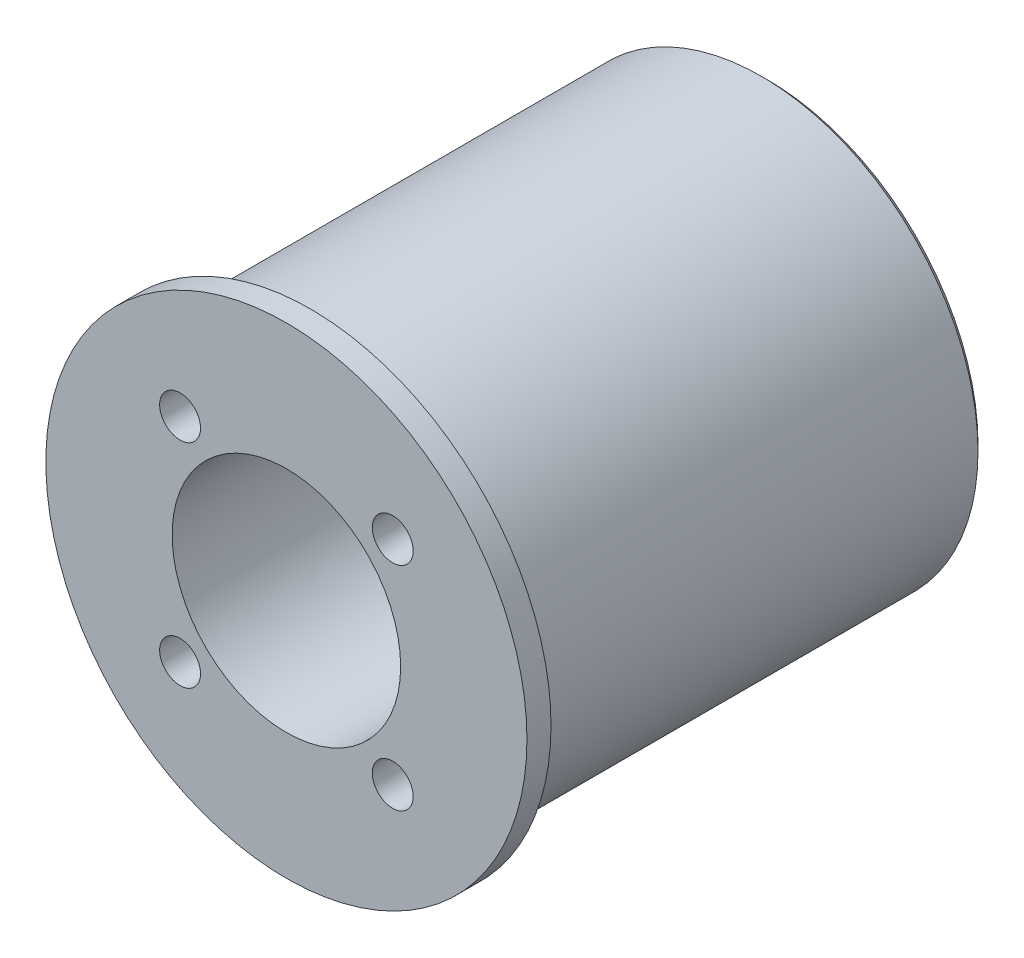
ISO-10303-21;
HEADER;
FILE_DESCRIPTION(('STEP AP214'),'2;1');
FILE_NAME('part.step','',(''),(''),'','','');
FILE_SCHEMA(('AUTOMOTIVE_DESIGN { 1 0 10303 214 1 1 1 1 }'));
ENDSEC;
DATA;
#1=APPLICATION_CONTEXT('core data for automotive mechanical design processes');
#2=APPLICATION_PROTOCOL_DEFINITION('international standard','automotive_design',2000,#1);
#3=PRODUCT_CONTEXT('',#1,'mechanical');
#4=PRODUCT('Part','Part','',(#3));
#5=PRODUCT_RELATED_PRODUCT_CATEGORY('part','',(#4));
#6=PRODUCT_DEFINITION_FORMATION('','',#4);
#7=PRODUCT_DEFINITION_CONTEXT('part definition',#1,'design');
#8=PRODUCT_DEFINITION('design','',#6,#7);
#9=PRODUCT_DEFINITION_SHAPE('','',#8);
#10=(LENGTH_UNIT() NAMED_UNIT(*) SI_UNIT(.MILLI.,.METRE.));
#11=(NAMED_UNIT(*) PLANE_ANGLE_UNIT() SI_UNIT($,.RADIAN.));
#12=(NAMED_UNIT(*) SI_UNIT($,.STERADIAN.) SOLID_ANGLE_UNIT());
#13=UNCERTAINTY_MEASURE_WITH_UNIT(LENGTH_MEASURE(1.E-05),#10,'distance_accuracy_value','');
#14=(GEOMETRIC_REPRESENTATION_CONTEXT(3) GLOBAL_UNCERTAINTY_ASSIGNED_CONTEXT((#13)) GLOBAL_UNIT_ASSIGNED_CONTEXT((#10,
#11,#12)) REPRESENTATION_CONTEXT('',''));
#15=CARTESIAN_POINT('',(0.,0.,0.));
#16=DIRECTION('',(0.,0.,1.));
#17=DIRECTION('',(1.,0.,0.));
#18=AXIS2_PLACEMENT_3D('',#15,#16,#17);
#19=CARTESIAN_POINT('',(0.,0.,40.));
#20=DIRECTION('',(0.,0.,-1.));
#21=DIRECTION('',(-1.,0.,0.));
#22=AXIS2_PLACEMENT_3D('',#19,#20,#21);
#23=CYLINDRICAL_SURFACE('',#22,18.);
#24=CARTESIAN_POINT('',(0.,0.,0.499999999999994));
#25=DIRECTION('',(0.,0.,1.));
#26=DIRECTION('',(1.,0.,0.));
#27=AXIS2_PLACEMENT_3D('',#24,#25,#26);
#28=CIRCLE('',#27,18.);
#29=CARTESIAN_POINT('',(18.,0.,0.499999999999994));
#30=VERTEX_POINT('',#29);
#31=EDGE_CURVE('E41',#30,#30,#28,.T.);
#32=ORIENTED_EDGE('',*,*,#31,.T.);
#33=EDGE_LOOP('',(#32));
#34=FACE_BOUND('',#33,.T.);
#35=CARTESIAN_POINT('',(0.,0.,38.));
#36=DIRECTION('',(0.,0.,1.));
#37=DIRECTION('',(1.,0.,0.));
#38=AXIS2_PLACEMENT_3D('',#35,#36,#37);
#39=CIRCLE('',#38,18.);
#40=CARTESIAN_POINT('',(18.,0.,38.));
#41=VERTEX_POINT('',#40);
#42=EDGE_CURVE('E45',#41,#41,#39,.T.);
#43=ORIENTED_EDGE('',*,*,#42,.F.);
#44=EDGE_LOOP('',(#43));
#45=FACE_BOUND('',#44,.T.);
#46=ADVANCED_FACE('F34',(#34,#45),#23,.T.);
#47=CARTESIAN_POINT('',(0.,0.,0.));
#48=DIRECTION('',(0.,0.,1.));
#49=DIRECTION('',(1.,0.,0.));
#50=AXIS2_PLACEMENT_3D('',#47,#48,#49);
#51=PLANE('',#50);
#52=CARTESIAN_POINT('',(0.,0.,0.));
#53=DIRECTION('',(0.,0.,1.));
#54=DIRECTION('',(1.,0.,0.));
#55=AXIS2_PLACEMENT_3D('',#52,#53,#54);
#56=CIRCLE('',#55,17.5);
#57=CARTESIAN_POINT('',(17.5,0.,0.));
#58=VERTEX_POINT('',#57);
#59=EDGE_CURVE('E11',#58,#58,#56,.F.);
#60=ORIENTED_EDGE('',*,*,#59,.T.);
#61=EDGE_LOOP('',(#60));
#62=FACE_BOUND('',#61,.T.);
#63=CARTESIAN_POINT('',(0.,0.,0.));
#64=DIRECTION('',(0.,0.,-1.));
#65=DIRECTION('',(-1.,0.,0.));
#66=AXIS2_PLACEMENT_3D('',#63,#64,#65);
#67=CIRCLE('',#66,8.);
#68=CARTESIAN_POINT('',(-8.,0.,0.));
#69=VERTEX_POINT('',#68);
#70=EDGE_CURVE('E55',#69,#69,#67,.T.);
#71=ORIENTED_EDGE('',*,*,#70,.F.);
#72=EDGE_LOOP('',(#71));
#73=FACE_BOUND('',#72,.T.);
#74=CARTESIAN_POINT('',(8.83883476483184,-8.83883476483185,0.));
#75=DIRECTION('',(0.,0.,-1.));
#76=DIRECTION('',(-1.,0.,0.));
#77=AXIS2_PLACEMENT_3D('',#74,#75,#76);
#78=CIRCLE('',#77,3.25);
#79=CARTESIAN_POINT('',(5.58883476483185,-8.83883476483185,0.));
#80=VERTEX_POINT('',#79);
#81=EDGE_CURVE('E107',#80,#80,#78,.T.);
#82=ORIENTED_EDGE('',*,*,#81,.F.);
#83=EDGE_LOOP('',(#82));
#84=FACE_BOUND('',#83,.T.);
#85=CARTESIAN_POINT('',(8.83883476483184,8.83883476483184,0.));
#86=DIRECTION('',(0.,0.,-1.));
#87=DIRECTION('',(-1.,0.,0.));
#88=AXIS2_PLACEMENT_3D('',#85,#86,#87);
#89=CIRCLE('',#88,3.25);
#90=CARTESIAN_POINT('',(5.58883476483185,8.83883476483184,0.));
#91=VERTEX_POINT('',#90);
#92=EDGE_CURVE('E95',#91,#91,#89,.T.);
#93=ORIENTED_EDGE('',*,*,#92,.F.);
#94=EDGE_LOOP('',(#93));
#95=FACE_BOUND('',#94,.T.);
#96=CARTESIAN_POINT('',(-8.83883476483185,-8.83883476483185,0.));
#97=DIRECTION('',(0.,0.,-1.));
#98=DIRECTION('',(-1.,0.,0.));
#99=AXIS2_PLACEMENT_3D('',#96,#97,#98);
#100=CIRCLE('',#99,3.25);
#101=CARTESIAN_POINT('',(-12.0888347648318,-8.83883476483185,0.));
#102=VERTEX_POINT('',#101);
#103=EDGE_CURVE('E83',#102,#102,#100,.T.);
#104=ORIENTED_EDGE('',*,*,#103,.F.);
#105=EDGE_LOOP('',(#104));
#106=FACE_BOUND('',#105,.T.);
#107=CARTESIAN_POINT('',(-8.83883476483185,8.83883476483184,0.));
#108=DIRECTION('',(0.,0.,-1.));
#109=DIRECTION('',(-1.,0.,0.));
#110=AXIS2_PLACEMENT_3D('',#107,#108,#109);
#111=CIRCLE('',#110,3.25);
#112=CARTESIAN_POINT('',(-12.0888347648318,8.83883476483184,0.));
#113=VERTEX_POINT('',#112);
#114=EDGE_CURVE('E71',#113,#113,#111,.T.);
#115=ORIENTED_EDGE('',*,*,#114,.F.);
#116=EDGE_LOOP('',(#115));
#117=FACE_BOUND('',#116,.T.);
#118=ADVANCED_FACE('F120',(#62,#73,#84,#95,#106,#117),#51,.F.);
#119=CARTESIAN_POINT('',(0.,0.,38.));
#120=DIRECTION('',(0.,0.,1.));
#121=DIRECTION('',(1.,0.,0.));
#122=AXIS2_PLACEMENT_3D('',#119,#120,#121);
#123=CYLINDRICAL_SURFACE('',#122,20.);
#124=CARTESIAN_POINT('',(0.,0.,38.));
#125=DIRECTION('',(0.,0.,1.));
#126=DIRECTION('',(1.,0.,0.));
#127=AXIS2_PLACEMENT_3D('',#124,#125,#126);
#128=CIRCLE('',#127,20.);
#129=CARTESIAN_POINT('',(20.,0.,38.));
#130=VERTEX_POINT('',#129);
#131=EDGE_CURVE('E49',#130,#130,#128,.T.);
#132=ORIENTED_EDGE('',*,*,#131,.T.);
#133=EDGE_LOOP('',(#132));
#134=FACE_BOUND('',#133,.T.);
#135=CARTESIAN_POINT('',(0.,0.,40.));
#136=DIRECTION('',(0.,0.,1.));
#137=DIRECTION('',(1.,0.,0.));
#138=AXIS2_PLACEMENT_3D('',#135,#136,#137);
#139=CIRCLE('',#138,20.);
#140=CARTESIAN_POINT('',(20.,0.,40.));
#141=VERTEX_POINT('',#140);
#142=EDGE_CURVE('E57',#141,#141,#139,.T.);
#143=ORIENTED_EDGE('',*,*,#142,.F.);
#144=EDGE_LOOP('',(#143));
#145=FACE_BOUND('',#144,.T.);
#146=ADVANCED_FACE('F123',(#134,#145),#123,.T.);
#147=CARTESIAN_POINT('',(0.,0.,38.));
#148=DIRECTION('',(0.,0.,1.));
#149=DIRECTION('',(1.,0.,0.));
#150=AXIS2_PLACEMENT_3D('',#147,#148,#149);
#151=PLANE('',#150);
#152=ORIENTED_EDGE('',*,*,#42,.T.);
#153=EDGE_LOOP('',(#152));
#154=FACE_BOUND('',#153,.T.);
#155=ORIENTED_EDGE('',*,*,#131,.F.);
#156=EDGE_LOOP('',(#155));
#157=FACE_BOUND('',#156,.T.);
#158=ADVANCED_FACE('F158',(#154,#157),#151,.F.);
#159=CARTESIAN_POINT('',(0.,0.,40.));
#160=DIRECTION('',(0.,0.,1.));
#161=DIRECTION('',(1.,0.,0.));
#162=AXIS2_PLACEMENT_3D('',#159,#160,#161);
#163=PLANE('',#162);
#164=CARTESIAN_POINT('',(0.,0.,40.));
#165=DIRECTION('',(0.,0.,1.));
#166=DIRECTION('',(1.,0.,0.));
#167=AXIS2_PLACEMENT_3D('',#164,#165,#166);
#168=CIRCLE('',#167,9.5);
#169=CARTESIAN_POINT('',(9.5,0.,40.));
#170=VERTEX_POINT('',#169);
#171=EDGE_CURVE('E54',#170,#170,#168,.T.);
#172=ORIENTED_EDGE('',*,*,#171,.F.);
#173=EDGE_LOOP('',(#172));
#174=FACE_BOUND('',#173,.T.);
#175=CARTESIAN_POINT('',(8.83883476483184,-8.83883476483185,40.));
#176=DIRECTION('',(0.,0.,-1.));
#177=DIRECTION('',(-1.,0.,0.));
#178=AXIS2_PLACEMENT_3D('',#175,#176,#177);
#179=CIRCLE('',#178,1.69999999999999);
#180=CARTESIAN_POINT('',(7.13883476483185,-8.83883476483185,40.));
#181=VERTEX_POINT('',#180);
#182=EDGE_CURVE('E98',#181,#181,#179,.T.);
#183=ORIENTED_EDGE('',*,*,#182,.T.);
#184=EDGE_LOOP('',(#183));
#185=FACE_BOUND('',#184,.T.);
#186=CARTESIAN_POINT('',(8.83883476483184,8.83883476483184,40.));
#187=DIRECTION('',(0.,0.,-1.));
#188=DIRECTION('',(-1.,0.,0.));
#189=AXIS2_PLACEMENT_3D('',#186,#187,#188);
#190=CIRCLE('',#189,1.69999999999999);
#191=CARTESIAN_POINT('',(7.13883476483185,8.83883476483184,40.));
#192=VERTEX_POINT('',#191);
#193=EDGE_CURVE('E86',#192,#192,#190,.T.);
#194=ORIENTED_EDGE('',*,*,#193,.T.);
#195=EDGE_LOOP('',(#194));
#196=FACE_BOUND('',#195,.T.);
#197=CARTESIAN_POINT('',(-8.83883476483185,-8.83883476483185,40.));
#198=DIRECTION('',(0.,0.,-1.));
#199=DIRECTION('',(-1.,0.,0.));
#200=AXIS2_PLACEMENT_3D('',#197,#198,#199);
#201=CIRCLE('',#200,1.69999999999999);
#202=CARTESIAN_POINT('',(-10.5388347648318,-8.83883476483185,40.));
#203=VERTEX_POINT('',#202);
#204=EDGE_CURVE('E74',#203,#203,#201,.T.);
#205=ORIENTED_EDGE('',*,*,#204,.T.);
#206=EDGE_LOOP('',(#205));
#207=FACE_BOUND('',#206,.T.);
#208=CARTESIAN_POINT('',(-8.83883476483185,8.83883476483184,40.));
#209=DIRECTION('',(0.,0.,-1.));
#210=DIRECTION('',(-1.,0.,0.));
#211=AXIS2_PLACEMENT_3D('',#208,#209,#210);
#212=CIRCLE('',#211,1.69999999999999);
#213=CARTESIAN_POINT('',(-10.5388347648318,8.83883476483184,40.));
#214=VERTEX_POINT('',#213);
#215=EDGE_CURVE('E60',#214,#214,#212,.T.);
#216=ORIENTED_EDGE('',*,*,#215,.T.);
#217=EDGE_LOOP('',(#216));
#218=FACE_BOUND('',#217,.T.);
#219=ORIENTED_EDGE('',*,*,#142,.T.);
#220=EDGE_LOOP('',(#219));
#221=FACE_BOUND('',#220,.T.);
#222=ADVANCED_FACE('F155',(#174,#185,#196,#207,#218,#221),#163,.T.);
#223=CARTESIAN_POINT('',(-8.83883476483185,8.83883476483184,0.));
#224=DIRECTION('',(0.,0.,-1.));
#225=DIRECTION('',(-1.,0.,0.));
#226=AXIS2_PLACEMENT_3D('',#223,#224,#225);
#227=CYLINDRICAL_SURFACE('',#226,1.7);
#228=ORIENTED_EDGE('',*,*,#215,.F.);
#229=EDGE_LOOP('',(#228));
#230=FACE_BOUND('',#229,.T.);
#231=CARTESIAN_POINT('',(-8.83883476483185,8.83883476483184,3.4));
#232=DIRECTION('',(0.,0.,-1.));
#233=DIRECTION('',(-1.,0.,0.));
#234=AXIS2_PLACEMENT_3D('',#231,#232,#233);
#235=CIRCLE('',#234,1.7);
#236=CARTESIAN_POINT('',(-10.5388347648319,8.83883476483184,3.4));
#237=VERTEX_POINT('',#236);
#238=EDGE_CURVE('E65',#237,#237,#235,.T.);
#239=ORIENTED_EDGE('',*,*,#238,.T.);
#240=EDGE_LOOP('',(#239));
#241=FACE_BOUND('',#240,.T.);
#242=ADVANCED_FACE('F146',(#230,#241),#227,.F.);
#243=CARTESIAN_POINT('',(-7.13883476483184,8.83883476483184,3.4));
#244=DIRECTION('',(0.,0.,1.));
#245=DIRECTION('',(1.,0.,0.));
#246=AXIS2_PLACEMENT_3D('',#243,#244,#245);
#247=PLANE('',#246);
#248=ORIENTED_EDGE('',*,*,#238,.F.);
#249=EDGE_LOOP('',(#248));
#250=FACE_BOUND('',#249,.T.);
#251=CARTESIAN_POINT('',(-8.83883476483185,8.83883476483184,3.4));
#252=DIRECTION('',(0.,0.,-1.));
#253=DIRECTION('',(-1.,0.,0.));
#254=AXIS2_PLACEMENT_3D('',#251,#252,#253);
#255=CIRCLE('',#254,3.25);
#256=CARTESIAN_POINT('',(-12.0888347648318,8.83883476483184,3.4));
#257=VERTEX_POINT('',#256);
#258=EDGE_CURVE('E68',#257,#257,#255,.T.);
#259=ORIENTED_EDGE('',*,*,#258,.T.);
#260=EDGE_LOOP('',(#259));
#261=FACE_BOUND('',#260,.T.);
#262=ADVANCED_FACE('F136',(#250,#261),#247,.F.);
#263=CARTESIAN_POINT('',(-8.83883476483185,8.83883476483184,0.));
#264=DIRECTION('',(0.,0.,-1.));
#265=DIRECTION('',(-1.,0.,0.));
#266=AXIS2_PLACEMENT_3D('',#263,#264,#265);
#267=CYLINDRICAL_SURFACE('',#266,3.25);
#268=ORIENTED_EDGE('',*,*,#258,.F.);
#269=EDGE_LOOP('',(#268));
#270=FACE_BOUND('',#269,.T.);
#271=ORIENTED_EDGE('',*,*,#114,.T.);
#272=EDGE_LOOP('',(#271));
#273=FACE_BOUND('',#272,.T.);
#274=ADVANCED_FACE('F133',(#270,#273),#267,.F.);
#275=CARTESIAN_POINT('',(-8.83883476483185,-8.83883476483185,0.));
#276=DIRECTION('',(0.,0.,-1.));
#277=DIRECTION('',(-1.,0.,0.));
#278=AXIS2_PLACEMENT_3D('',#275,#276,#277);
#279=CYLINDRICAL_SURFACE('',#278,1.7);
#280=ORIENTED_EDGE('',*,*,#204,.F.);
#281=EDGE_LOOP('',(#280));
#282=FACE_BOUND('',#281,.T.);
#283=CARTESIAN_POINT('',(-8.83883476483185,-8.83883476483185,3.4));
#284=DIRECTION('',(0.,0.,-1.));
#285=DIRECTION('',(-1.,0.,0.));
#286=AXIS2_PLACEMENT_3D('',#283,#284,#285);
#287=CIRCLE('',#286,1.7);
#288=CARTESIAN_POINT('',(-10.5388347648319,-8.83883476483185,3.4));
#289=VERTEX_POINT('',#288);
#290=EDGE_CURVE('E77',#289,#289,#287,.T.);
#291=ORIENTED_EDGE('',*,*,#290,.T.);
#292=EDGE_LOOP('',(#291));
#293=FACE_BOUND('',#292,.T.);
#294=ADVANCED_FACE('F135',(#282,#293),#279,.F.);
#295=CARTESIAN_POINT('',(-7.13883476483184,-8.83883476483185,3.4));
#296=DIRECTION('',(0.,0.,1.));
#297=DIRECTION('',(1.,0.,0.));
#298=AXIS2_PLACEMENT_3D('',#295,#296,#297);
#299=PLANE('',#298);
#300=ORIENTED_EDGE('',*,*,#290,.F.);
#301=EDGE_LOOP('',(#300));
#302=FACE_BOUND('',#301,.T.);
#303=CARTESIAN_POINT('',(-8.83883476483185,-8.83883476483185,3.4));
#304=DIRECTION('',(0.,0.,-1.));
#305=DIRECTION('',(-1.,0.,0.));
#306=AXIS2_PLACEMENT_3D('',#303,#304,#305);
#307=CIRCLE('',#306,3.25);
#308=CARTESIAN_POINT('',(-12.0888347648318,-8.83883476483185,3.4));
#309=VERTEX_POINT('',#308);
#310=EDGE_CURVE('E80',#309,#309,#307,.T.);
#311=ORIENTED_EDGE('',*,*,#310,.T.);
#312=EDGE_LOOP('',(#311));
#313=FACE_BOUND('',#312,.T.);
#314=ADVANCED_FACE('F143',(#302,#313),#299,.F.);
#315=CARTESIAN_POINT('',(-8.83883476483185,-8.83883476483185,0.));
#316=DIRECTION('',(0.,0.,-1.));
#317=DIRECTION('',(-1.,0.,0.));
#318=AXIS2_PLACEMENT_3D('',#315,#316,#317);
#319=CYLINDRICAL_SURFACE('',#318,3.25);
#320=ORIENTED_EDGE('',*,*,#310,.F.);
#321=EDGE_LOOP('',(#320));
#322=FACE_BOUND('',#321,.T.);
#323=ORIENTED_EDGE('',*,*,#103,.T.);
#324=EDGE_LOOP('',(#323));
#325=FACE_BOUND('',#324,.T.);
#326=ADVANCED_FACE('F204',(#322,#325),#319,.F.);
#327=CARTESIAN_POINT('',(8.83883476483184,8.83883476483184,0.));
#328=DIRECTION('',(0.,0.,-1.));
#329=DIRECTION('',(-1.,0.,0.));
#330=AXIS2_PLACEMENT_3D('',#327,#328,#329);
#331=CYLINDRICAL_SURFACE('',#330,1.7);
#332=ORIENTED_EDGE('',*,*,#193,.F.);
#333=EDGE_LOOP('',(#332));
#334=FACE_BOUND('',#333,.T.);
#335=CARTESIAN_POINT('',(8.83883476483184,8.83883476483184,3.4));
#336=DIRECTION('',(0.,0.,-1.));
#337=DIRECTION('',(-1.,0.,0.));
#338=AXIS2_PLACEMENT_3D('',#335,#336,#337);
#339=CIRCLE('',#338,1.7);
#340=CARTESIAN_POINT('',(7.13883476483184,8.83883476483184,3.4));
#341=VERTEX_POINT('',#340);
#342=EDGE_CURVE('E89',#341,#341,#339,.T.);
#343=ORIENTED_EDGE('',*,*,#342,.T.);
#344=EDGE_LOOP('',(#343));
#345=FACE_BOUND('',#344,.T.);
#346=ADVANCED_FACE('F214',(#334,#345),#331,.F.);
#347=CARTESIAN_POINT('',(10.5388347648318,8.83883476483184,3.4));
#348=DIRECTION('',(0.,0.,1.));
#349=DIRECTION('',(1.,0.,0.));
#350=AXIS2_PLACEMENT_3D('',#347,#348,#349);
#351=PLANE('',#350);
#352=ORIENTED_EDGE('',*,*,#342,.F.);
#353=EDGE_LOOP('',(#352));
#354=FACE_BOUND('',#353,.T.);
#355=CARTESIAN_POINT('',(8.83883476483184,8.83883476483184,3.4));
#356=DIRECTION('',(0.,0.,-1.));
#357=DIRECTION('',(-1.,0.,0.));
#358=AXIS2_PLACEMENT_3D('',#355,#356,#357);
#359=CIRCLE('',#358,3.25);
#360=CARTESIAN_POINT('',(5.58883476483184,8.83883476483184,3.4));
#361=VERTEX_POINT('',#360);
#362=EDGE_CURVE('E92',#361,#361,#359,.T.);
#363=ORIENTED_EDGE('',*,*,#362,.T.);
#364=EDGE_LOOP('',(#363));
#365=FACE_BOUND('',#364,.T.);
#366=ADVANCED_FACE('F224',(#354,#365),#351,.F.);
#367=CARTESIAN_POINT('',(8.83883476483184,8.83883476483184,0.));
#368=DIRECTION('',(0.,0.,-1.));
#369=DIRECTION('',(-1.,0.,0.));
#370=AXIS2_PLACEMENT_3D('',#367,#368,#369);
#371=CYLINDRICAL_SURFACE('',#370,3.25);
#372=ORIENTED_EDGE('',*,*,#362,.F.);
#373=EDGE_LOOP('',(#372));
#374=FACE_BOUND('',#373,.T.);
#375=ORIENTED_EDGE('',*,*,#92,.T.);
#376=EDGE_LOOP('',(#375));
#377=FACE_BOUND('',#376,.T.);
#378=ADVANCED_FACE('F234',(#374,#377),#371,.F.);
#379=CARTESIAN_POINT('',(8.83883476483184,-8.83883476483185,0.));
#380=DIRECTION('',(0.,0.,-1.));
#381=DIRECTION('',(-1.,0.,0.));
#382=AXIS2_PLACEMENT_3D('',#379,#380,#381);
#383=CYLINDRICAL_SURFACE('',#382,1.7);
#384=ORIENTED_EDGE('',*,*,#182,.F.);
#385=EDGE_LOOP('',(#384));
#386=FACE_BOUND('',#385,.T.);
#387=CARTESIAN_POINT('',(8.83883476483184,-8.83883476483185,3.4));
#388=DIRECTION('',(0.,0.,-1.));
#389=DIRECTION('',(-1.,0.,0.));
#390=AXIS2_PLACEMENT_3D('',#387,#388,#389);
#391=CIRCLE('',#390,1.7);
#392=CARTESIAN_POINT('',(7.13883476483184,-8.83883476483185,3.4));
#393=VERTEX_POINT('',#392);
#394=EDGE_CURVE('E101',#393,#393,#391,.T.);
#395=ORIENTED_EDGE('',*,*,#394,.T.);
#396=EDGE_LOOP('',(#395));
#397=FACE_BOUND('',#396,.T.);
#398=ADVANCED_FACE('F244',(#386,#397),#383,.F.);
#399=CARTESIAN_POINT('',(10.5388347648318,-8.83883476483185,3.4));
#400=DIRECTION('',(0.,0.,1.));
#401=DIRECTION('',(1.,0.,0.));
#402=AXIS2_PLACEMENT_3D('',#399,#400,#401);
#403=PLANE('',#402);
#404=ORIENTED_EDGE('',*,*,#394,.F.);
#405=EDGE_LOOP('',(#404));
#406=FACE_BOUND('',#405,.T.);
#407=CARTESIAN_POINT('',(8.83883476483184,-8.83883476483185,3.4));
#408=DIRECTION('',(0.,0.,-1.));
#409=DIRECTION('',(-1.,0.,0.));
#410=AXIS2_PLACEMENT_3D('',#407,#408,#409);
#411=CIRCLE('',#410,3.25);
#412=CARTESIAN_POINT('',(5.58883476483184,-8.83883476483185,3.4));
#413=VERTEX_POINT('',#412);
#414=EDGE_CURVE('E104',#413,#413,#411,.T.);
#415=ORIENTED_EDGE('',*,*,#414,.T.);
#416=EDGE_LOOP('',(#415));
#417=FACE_BOUND('',#416,.T.);
#418=ADVANCED_FACE('F254',(#406,#417),#403,.F.);
#419=CARTESIAN_POINT('',(8.83883476483184,-8.83883476483185,0.));
#420=DIRECTION('',(0.,0.,-1.));
#421=DIRECTION('',(-1.,0.,0.));
#422=AXIS2_PLACEMENT_3D('',#419,#420,#421);
#423=CYLINDRICAL_SURFACE('',#422,3.25);
#424=ORIENTED_EDGE('',*,*,#414,.F.);
#425=EDGE_LOOP('',(#424));
#426=FACE_BOUND('',#425,.T.);
#427=ORIENTED_EDGE('',*,*,#81,.T.);
#428=EDGE_LOOP('',(#427));
#429=FACE_BOUND('',#428,.T.);
#430=ADVANCED_FACE('F264',(#426,#429),#423,.F.);
#431=CARTESIAN_POINT('',(0.,0.,5.));
#432=DIRECTION('',(0.,0.,1.));
#433=DIRECTION('',(1.,0.,0.));
#434=AXIS2_PLACEMENT_3D('',#431,#432,#433);
#435=PLANE('',#434);
#436=CARTESIAN_POINT('',(0.,0.,5.));
#437=DIRECTION('',(0.,0.,1.));
#438=DIRECTION('',(1.,0.,0.));
#439=AXIS2_PLACEMENT_3D('',#436,#437,#438);
#440=CIRCLE('',#439,8.);
#441=CARTESIAN_POINT('',(8.,0.,5.));
#442=VERTEX_POINT('',#441);
#443=EDGE_CURVE('E52',#442,#442,#440,.T.);
#444=ORIENTED_EDGE('',*,*,#443,.F.);
#445=EDGE_LOOP('',(#444));
#446=FACE_BOUND('',#445,.T.);
#447=CARTESIAN_POINT('',(0.,0.,5.));
#448=DIRECTION('',(0.,0.,1.));
#449=DIRECTION('',(1.,0.,0.));
#450=AXIS2_PLACEMENT_3D('',#447,#448,#449);
#451=CIRCLE('',#450,9.5);
#452=CARTESIAN_POINT('',(9.5,0.,5.));
#453=VERTEX_POINT('',#452);
#454=EDGE_CURVE('E110',#453,#453,#451,.F.);
#455=ORIENTED_EDGE('',*,*,#454,.F.);
#456=EDGE_LOOP('',(#455));
#457=FACE_BOUND('',#456,.T.);
#458=ADVANCED_FACE('F273',(#446,#457),#435,.T.);
#459=CARTESIAN_POINT('',(0.,0.,-26.8700576850888));
#460=DIRECTION('',(0.,0.,1.));
#461=DIRECTION('',(1.,0.,0.));
#462=AXIS2_PLACEMENT_3D('',#459,#460,#461);
#463=CYLINDRICAL_SURFACE('',#462,9.5);
#464=ORIENTED_EDGE('',*,*,#454,.T.);
#465=EDGE_LOOP('',(#464));
#466=FACE_BOUND('',#465,.T.);
#467=ORIENTED_EDGE('',*,*,#171,.T.);
#468=EDGE_LOOP('',(#467));
#469=FACE_BOUND('',#468,.T.);
#470=ADVANCED_FACE('F288',(#466,#469),#463,.F.);
#471=CARTESIAN_POINT('',(0.,0.,40.));
#472=DIRECTION('',(0.,0.,-1.));
#473=DIRECTION('',(-1.,0.,0.));
#474=AXIS2_PLACEMENT_3D('',#471,#472,#473);
#475=CYLINDRICAL_SURFACE('',#474,8.);
#476=ORIENTED_EDGE('',*,*,#443,.T.);
#477=EDGE_LOOP('',(#476));
#478=FACE_BOUND('',#477,.T.);
#479=ORIENTED_EDGE('',*,*,#70,.T.);
#480=EDGE_LOOP('',(#479));
#481=FACE_BOUND('',#480,.T.);
#482=ADVANCED_FACE('F118',(#478,#481),#475,.F.);
#483=CARTESIAN_POINT('',(0.,0.,0.499999999999994));
#484=DIRECTION('',(0.,0.,1.));
#485=DIRECTION('',(1.,0.,0.));
#486=AXIS2_PLACEMENT_3D('',#483,#484,#485);
#487=CONICAL_SURFACE('',#486,18.,0.785398163397452);
#488=ORIENTED_EDGE('',*,*,#59,.F.);
#489=EDGE_LOOP('',(#488));
#490=FACE_BOUND('',#489,.T.);
#491=ORIENTED_EDGE('',*,*,#31,.F.);
#492=EDGE_LOOP('',(#491));
#493=FACE_BOUND('',#492,.T.);
#494=ADVANCED_FACE('F36',(#490,#493),#487,.T.);
#495=CLOSED_SHELL('',(#46,#118,#146,#158,#222,#242,#262,#274,#294,#314,#326,#346,#366,#378,#398,
#418,#430,#458,#470,#482,#494));
#496=MANIFOLD_SOLID_BREP('B2',#495);
#497=ADVANCED_BREP_SHAPE_REPRESENTATION('',(#18,#496),#14);
#498=SHAPE_DEFINITION_REPRESENTATION(#9,#497);
ENDSEC;
END-ISO-10303-21;
